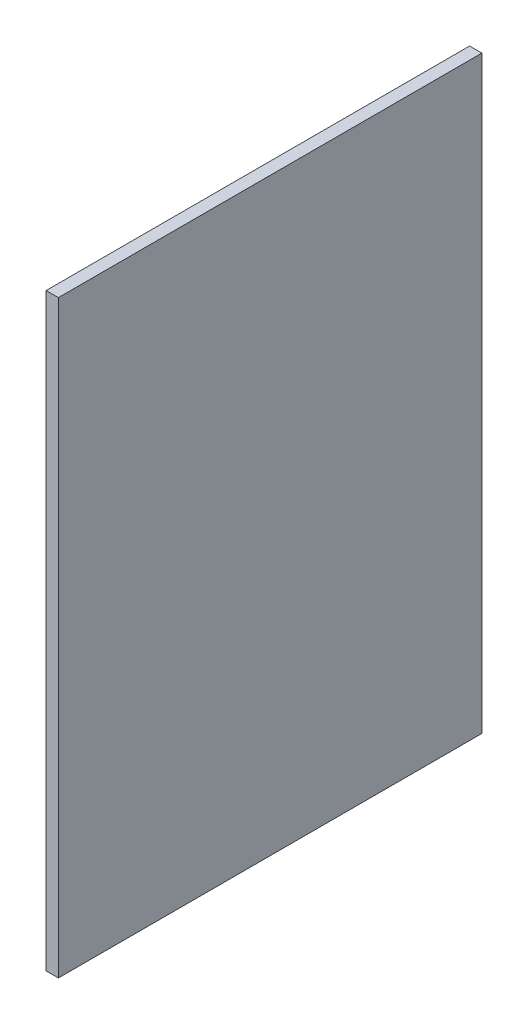
ISO-10303-21;
HEADER;
FILE_DESCRIPTION(('STEP AP214'),'2;1');
FILE_NAME('part.step','',(''),(''),'','','');
FILE_SCHEMA(('AUTOMOTIVE_DESIGN { 1 0 10303 214 1 1 1 1 }'));
ENDSEC;
DATA;
#1=APPLICATION_CONTEXT('core data for automotive mechanical design processes');
#2=APPLICATION_PROTOCOL_DEFINITION('international standard','automotive_design',2000,#1);
#3=PRODUCT_CONTEXT('',#1,'mechanical');
#4=PRODUCT('Part','Part','',(#3));
#5=PRODUCT_RELATED_PRODUCT_CATEGORY('part','',(#4));
#6=PRODUCT_DEFINITION_FORMATION('','',#4);
#7=PRODUCT_DEFINITION_CONTEXT('part definition',#1,'design');
#8=PRODUCT_DEFINITION('design','',#6,#7);
#9=PRODUCT_DEFINITION_SHAPE('','',#8);
#10=(LENGTH_UNIT() NAMED_UNIT(*) SI_UNIT(.MILLI.,.METRE.));
#11=(NAMED_UNIT(*) PLANE_ANGLE_UNIT() SI_UNIT($,.RADIAN.));
#12=(NAMED_UNIT(*) SI_UNIT($,.STERADIAN.) SOLID_ANGLE_UNIT());
#13=UNCERTAINTY_MEASURE_WITH_UNIT(LENGTH_MEASURE(1.E-05),#10,'distance_accuracy_value','');
#14=(GEOMETRIC_REPRESENTATION_CONTEXT(3) GLOBAL_UNCERTAINTY_ASSIGNED_CONTEXT((#13)) GLOBAL_UNIT_ASSIGNED_CONTEXT((#10,
#11,#12)) REPRESENTATION_CONTEXT('',''));
#15=CARTESIAN_POINT('',(0.,0.,0.));
#16=DIRECTION('',(0.,0.,1.));
#17=DIRECTION('',(1.,0.,0.));
#18=AXIS2_PLACEMENT_3D('',#15,#16,#17);
#19=CARTESIAN_POINT('',(25.4,0.,0.));
#20=DIRECTION('',(0.,0.,-1.));
#21=DIRECTION('',(-1.,0.,0.));
#22=AXIS2_PLACEMENT_3D('',#19,#20,#21);
#23=PLANE('',#22);
#24=DIRECTION('',(0.,-1.,0.));
#25=VECTOR('',#24,1.);
#26=CARTESIAN_POINT('',(0.,0.,0.));
#27=LINE('',#26,#25);
#28=CARTESIAN_POINT('',(0.,0.,0.));
#29=VERTEX_POINT('',#28);
#30=CARTESIAN_POINT('',(0.,-1219.2,0.));
#31=VERTEX_POINT('',#30);
#32=EDGE_CURVE('E96',#29,#31,#27,.T.);
#33=ORIENTED_EDGE('',*,*,#32,.T.);
#34=DIRECTION('',(-1.,0.,0.));
#35=VECTOR('',#34,1.);
#36=CARTESIAN_POINT('',(25.4,-1219.2,0.));
#37=LINE('',#36,#35);
#38=CARTESIAN_POINT('',(25.4,-1219.2,0.));
#39=VERTEX_POINT('',#38);
#40=EDGE_CURVE('E11',#39,#31,#37,.T.);
#41=ORIENTED_EDGE('',*,*,#40,.F.);
#42=DIRECTION('',(0.,-1.,0.));
#43=VECTOR('',#42,1.);
#44=CARTESIAN_POINT('',(25.4,0.,0.));
#45=LINE('',#44,#43);
#46=CARTESIAN_POINT('',(25.4,0.,0.));
#47=VERTEX_POINT('',#46);
#48=EDGE_CURVE('E84',#47,#39,#45,.T.);
#49=ORIENTED_EDGE('',*,*,#48,.F.);
#50=DIRECTION('',(-1.,0.,0.));
#51=VECTOR('',#50,1.);
#52=CARTESIAN_POINT('',(25.4,0.,0.));
#53=LINE('',#52,#51);
#54=EDGE_CURVE('E92',#47,#29,#53,.T.);
#55=ORIENTED_EDGE('',*,*,#54,.T.);
#56=EDGE_LOOP('',(#33,#41,#49,#55));
#57=FACE_BOUND('',#56,.T.);
#58=ADVANCED_FACE('F33',(#57),#23,.F.);
#59=CARTESIAN_POINT('',(25.4,-1219.2,0.));
#60=DIRECTION('',(0.,1.,0.));
#61=DIRECTION('',(0.,0.,1.));
#62=AXIS2_PLACEMENT_3D('',#59,#60,#61);
#63=PLANE('',#62);
#64=DIRECTION('',(0.,0.,-1.));
#65=VECTOR('',#64,1.);
#66=CARTESIAN_POINT('',(0.,-1219.2,0.));
#67=LINE('',#66,#65);
#68=CARTESIAN_POINT('',(0.,-1219.2,-876.3));
#69=VERTEX_POINT('',#68);
#70=EDGE_CURVE('E88',#31,#69,#67,.T.);
#71=ORIENTED_EDGE('',*,*,#70,.T.);
#72=DIRECTION('',(-1.,0.,0.));
#73=VECTOR('',#72,1.);
#74=CARTESIAN_POINT('',(25.4,-1219.2,-876.3));
#75=LINE('',#74,#73);
#76=CARTESIAN_POINT('',(25.4,-1219.2,-876.3));
#77=VERTEX_POINT('',#76);
#78=EDGE_CURVE('E41',#77,#69,#75,.T.);
#79=ORIENTED_EDGE('',*,*,#78,.F.);
#80=DIRECTION('',(0.,0.,-1.));
#81=VECTOR('',#80,1.);
#82=CARTESIAN_POINT('',(25.4,-1219.2,0.));
#83=LINE('',#82,#81);
#84=EDGE_CURVE('E79',#39,#77,#83,.T.);
#85=ORIENTED_EDGE('',*,*,#84,.F.);
#86=ORIENTED_EDGE('',*,*,#40,.T.);
#87=EDGE_LOOP('',(#71,#79,#85,#86));
#88=FACE_BOUND('',#87,.T.);
#89=ADVANCED_FACE('F87',(#88),#63,.F.);
#90=CARTESIAN_POINT('',(25.4,0.,-876.3));
#91=DIRECTION('',(0.,0.,1.));
#92=DIRECTION('',(0.,-1.,0.));
#93=AXIS2_PLACEMENT_3D('',#90,#91,#92);
#94=PLANE('',#93);
#95=DIRECTION('',(0.,1.,0.));
#96=VECTOR('',#95,1.);
#97=CARTESIAN_POINT('',(0.,0.,-876.3));
#98=LINE('',#97,#96);
#99=CARTESIAN_POINT('',(0.,0.,-876.3));
#100=VERTEX_POINT('',#99);
#101=EDGE_CURVE('E66',#69,#100,#98,.T.);
#102=ORIENTED_EDGE('',*,*,#101,.T.);
#103=DIRECTION('',(-1.,0.,0.));
#104=VECTOR('',#103,1.);
#105=CARTESIAN_POINT('',(25.4,0.,-876.3));
#106=LINE('',#105,#104);
#107=CARTESIAN_POINT('',(25.4,0.,-876.3));
#108=VERTEX_POINT('',#107);
#109=EDGE_CURVE('E89',#108,#100,#106,.T.);
#110=ORIENTED_EDGE('',*,*,#109,.F.);
#111=DIRECTION('',(0.,1.,0.));
#112=VECTOR('',#111,1.);
#113=CARTESIAN_POINT('',(25.4,0.,-876.3));
#114=LINE('',#113,#112);
#115=EDGE_CURVE('E82',#77,#108,#114,.T.);
#116=ORIENTED_EDGE('',*,*,#115,.F.);
#117=ORIENTED_EDGE('',*,*,#78,.T.);
#118=EDGE_LOOP('',(#102,#110,#116,#117));
#119=FACE_BOUND('',#118,.T.);
#120=ADVANCED_FACE('F90',(#119),#94,.F.);
#121=CARTESIAN_POINT('',(25.4,0.,0.));
#122=DIRECTION('',(0.,-1.,0.));
#123=DIRECTION('',(0.,0.,-1.));
#124=AXIS2_PLACEMENT_3D('',#121,#122,#123);
#125=PLANE('',#124);
#126=DIRECTION('',(0.,0.,1.));
#127=VECTOR('',#126,1.);
#128=CARTESIAN_POINT('',(0.,0.,0.));
#129=LINE('',#128,#127);
#130=EDGE_CURVE('E72',#100,#29,#129,.T.);
#131=ORIENTED_EDGE('',*,*,#130,.T.);
#132=ORIENTED_EDGE('',*,*,#54,.F.);
#133=DIRECTION('',(0.,0.,1.));
#134=VECTOR('',#133,1.);
#135=CARTESIAN_POINT('',(25.4,0.,0.));
#136=LINE('',#135,#134);
#137=EDGE_CURVE('E49',#108,#47,#136,.T.);
#138=ORIENTED_EDGE('',*,*,#137,.F.);
#139=ORIENTED_EDGE('',*,*,#109,.T.);
#140=EDGE_LOOP('',(#131,#132,#138,#139));
#141=FACE_BOUND('',#140,.T.);
#142=ADVANCED_FACE('F103',(#141),#125,.F.);
#143=CARTESIAN_POINT('',(25.4,0.,0.));
#144=DIRECTION('',(1.,0.,0.));
#145=DIRECTION('',(0.,0.,-1.));
#146=AXIS2_PLACEMENT_3D('',#143,#144,#145);
#147=PLANE('',#146);
#148=ORIENTED_EDGE('',*,*,#48,.T.);
#149=ORIENTED_EDGE('',*,*,#84,.T.);
#150=ORIENTED_EDGE('',*,*,#115,.T.);
#151=ORIENTED_EDGE('',*,*,#137,.T.);
#152=EDGE_LOOP('',(#148,#149,#150,#151));
#153=FACE_BOUND('',#152,.T.);
#154=ADVANCED_FACE('F80',(#153),#147,.T.);
#155=CARTESIAN_POINT('',(0.,0.,0.));
#156=DIRECTION('',(1.,0.,0.));
#157=DIRECTION('',(0.,0.,-1.));
#158=AXIS2_PLACEMENT_3D('',#155,#156,#157);
#159=PLANE('',#158);
#160=ORIENTED_EDGE('',*,*,#32,.F.);
#161=ORIENTED_EDGE('',*,*,#130,.F.);
#162=ORIENTED_EDGE('',*,*,#101,.F.);
#163=ORIENTED_EDGE('',*,*,#70,.F.);
#164=EDGE_LOOP('',(#160,#161,#162,#163));
#165=FACE_BOUND('',#164,.T.);
#166=ADVANCED_FACE('F106',(#165),#159,.F.);
#167=CLOSED_SHELL('',(#58,#89,#120,#142,#154,#166));
#168=MANIFOLD_SOLID_BREP('B2',#167);
#169=ADVANCED_BREP_SHAPE_REPRESENTATION('',(#18,#168),#14);
#170=SHAPE_DEFINITION_REPRESENTATION(#9,#169);
ENDSEC;
END-ISO-10303-21;
